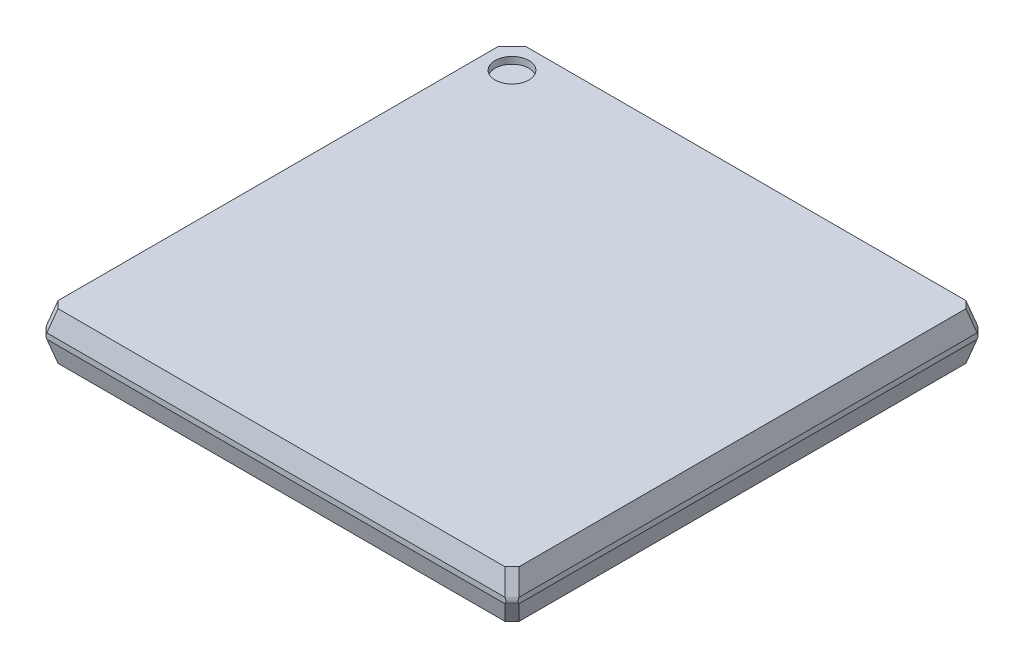
ISO-10303-21;
HEADER;
FILE_DESCRIPTION(('STEP AP214'),'2;1');
FILE_NAME('part.step','',(''),(''),'','','');
FILE_SCHEMA(('AUTOMOTIVE_DESIGN { 1 0 10303 214 1 1 1 1 }'));
ENDSEC;
DATA;
#1=APPLICATION_CONTEXT('core data for automotive mechanical design processes');
#2=APPLICATION_PROTOCOL_DEFINITION('international standard','automotive_design',2000,#1);
#3=PRODUCT_CONTEXT('',#1,'mechanical');
#4=PRODUCT('Part','Part','',(#3));
#5=PRODUCT_RELATED_PRODUCT_CATEGORY('part','',(#4));
#6=PRODUCT_DEFINITION_FORMATION('','',#4);
#7=PRODUCT_DEFINITION_CONTEXT('part definition',#1,'design');
#8=PRODUCT_DEFINITION('design','',#6,#7);
#9=PRODUCT_DEFINITION_SHAPE('','',#8);
#10=(LENGTH_UNIT() NAMED_UNIT(*) SI_UNIT(.MILLI.,.METRE.));
#11=(NAMED_UNIT(*) PLANE_ANGLE_UNIT() SI_UNIT($,.RADIAN.));
#12=(NAMED_UNIT(*) SI_UNIT($,.STERADIAN.) SOLID_ANGLE_UNIT());
#13=UNCERTAINTY_MEASURE_WITH_UNIT(LENGTH_MEASURE(1.E-05),#10,'distance_accuracy_value','');
#14=(GEOMETRIC_REPRESENTATION_CONTEXT(3) GLOBAL_UNCERTAINTY_ASSIGNED_CONTEXT((#13)) GLOBAL_UNIT_ASSIGNED_CONTEXT((#10,
#11,#12)) REPRESENTATION_CONTEXT('',''));
#15=CARTESIAN_POINT('',(0.,0.,0.));
#16=DIRECTION('',(0.,0.,1.));
#17=DIRECTION('',(1.,0.,0.));
#18=AXIS2_PLACEMENT_3D('',#15,#16,#17);
#19=CARTESIAN_POINT('',(-6.,0.5,-6.));
#20=DIRECTION('',(0.,1.,0.));
#21=DIRECTION('',(0.,0.,1.));
#22=AXIS2_PLACEMENT_3D('',#19,#20,#21);
#23=PLANE('',#22);
#24=CARTESIAN_POINT('',(-6.,0.5,-6.));
#25=DIRECTION('',(0.,-1.,0.));
#26=DIRECTION('',(0.,0.,-1.));
#27=AXIS2_PLACEMENT_3D('',#24,#25,#26);
#28=CIRCLE('',#27,0.5);
#29=CARTESIAN_POINT('',(-6.,0.5,-6.5));
#30=VERTEX_POINT('',#29);
#31=EDGE_CURVE('E19',#30,#30,#28,.F.);
#32=ORIENTED_EDGE('',*,*,#31,.T.);
#33=EDGE_LOOP('',(#32));
#34=FACE_BOUND('',#33,.T.);
#35=ADVANCED_FACE('F16',(#34),#23,.T.);
#36=CARTESIAN_POINT('',(-6.,0.7,-6.));
#37=DIRECTION('',(0.,-1.,0.));
#38=DIRECTION('',(0.,0.,-1.));
#39=AXIS2_PLACEMENT_3D('',#36,#37,#38);
#40=CYLINDRICAL_SURFACE('',#39,0.5);
#41=CARTESIAN_POINT('',(-6.,0.7,-6.));
#42=DIRECTION('',(0.,-1.,0.));
#43=DIRECTION('',(0.,0.,-1.));
#44=AXIS2_PLACEMENT_3D('',#41,#42,#43);
#45=CIRCLE('',#44,0.5);
#46=CARTESIAN_POINT('',(-6.,0.7,-6.5));
#47=VERTEX_POINT('',#46);
#48=EDGE_CURVE('E321',#47,#47,#45,.T.);
#49=ORIENTED_EDGE('',*,*,#48,.F.);
#50=EDGE_LOOP('',(#49));
#51=FACE_BOUND('',#50,.T.);
#52=ORIENTED_EDGE('',*,*,#31,.F.);
#53=EDGE_LOOP('',(#52));
#54=FACE_BOUND('',#53,.T.);
#55=ADVANCED_FACE('F376',(#51,#54),#40,.F.);
#56=CARTESIAN_POINT('',(0.,0.7,0.));
#57=DIRECTION('',(0.,1.,0.));
#58=DIRECTION('',(0.,0.,1.));
#59=AXIS2_PLACEMENT_3D('',#56,#57,#58);
#60=PLANE('',#59);
#61=ORIENTED_EDGE('',*,*,#48,.T.);
#62=EDGE_LOOP('',(#61));
#63=FACE_BOUND('',#62,.T.);
#64=DIRECTION('',(0.707106781186548,0.,0.707106781186548));
#65=VECTOR('',#64,1.);
#66=CARTESIAN_POINT('',(-6.70914048806276,0.699999999999998,6.70914048806276));
#67=LINE('',#66,#65);
#68=CARTESIAN_POINT('',(-6.60584541082731,0.699999999999998,6.81243556529822));
#69=VERTEX_POINT('',#68);
#70=CARTESIAN_POINT('',(-6.81243556529822,0.699999999999999,6.60584541082731));
#71=VERTEX_POINT('',#70);
#72=EDGE_CURVE('E296',#69,#71,#67,.F.);
#73=ORIENTED_EDGE('',*,*,#72,.F.);
#74=DIRECTION('',(1.,0.,0.));
#75=VECTOR('',#74,1.);
#76=CARTESIAN_POINT('',(-3.5,0.699999999999999,6.81243556529822));
#77=LINE('',#76,#75);
#78=CARTESIAN_POINT('',(6.60584541082731,0.699999999999999,6.81243556529822));
#79=VERTEX_POINT('',#78);
#80=EDGE_CURVE('E302',#79,#69,#77,.F.);
#81=ORIENTED_EDGE('',*,*,#80,.F.);
#82=DIRECTION('',(0.707106781186548,0.,-0.707106781186548));
#83=VECTOR('',#82,1.);
#84=CARTESIAN_POINT('',(6.60584541082731,0.7,6.81243556529822));
#85=LINE('',#84,#83);
#86=CARTESIAN_POINT('',(6.81243556529822,0.699999999999999,6.60584541082731));
#87=VERTEX_POINT('',#86);
#88=EDGE_CURVE('E328',#79,#87,#85,.T.);
#89=ORIENTED_EDGE('',*,*,#88,.T.);
#90=DIRECTION('',(0.,0.,1.));
#91=VECTOR('',#90,1.);
#92=CARTESIAN_POINT('',(6.81243556529822,0.699999999999999,3.5));
#93=LINE('',#92,#91);
#94=CARTESIAN_POINT('',(6.81243556529822,0.7,-6.60584541082732));
#95=VERTEX_POINT('',#94);
#96=EDGE_CURVE('E231',#95,#87,#93,.T.);
#97=ORIENTED_EDGE('',*,*,#96,.F.);
#98=DIRECTION('',(-0.70710678118655,0.,-0.707106781186545));
#99=VECTOR('',#98,1.);
#100=CARTESIAN_POINT('',(6.70914048806277,0.700000000000003,-6.70914048806276));
#101=LINE('',#100,#99);
#102=CARTESIAN_POINT('',(6.60584541082731,0.700000000000002,-6.81243556529822));
#103=VERTEX_POINT('',#102);
#104=EDGE_CURVE('E244',#103,#95,#101,.F.);
#105=ORIENTED_EDGE('',*,*,#104,.F.);
#106=DIRECTION('',(1.,0.,0.));
#107=VECTOR('',#106,1.);
#108=CARTESIAN_POINT('',(3.5,0.699999999999999,-6.81243556529822));
#109=LINE('',#108,#107);
#110=CARTESIAN_POINT('',(-6.39925525635641,0.7,-6.81243556529822));
#111=VERTEX_POINT('',#110);
#112=EDGE_CURVE('E257',#111,#103,#109,.T.);
#113=ORIENTED_EDGE('',*,*,#112,.F.);
#114=DIRECTION('',(-0.707106781186547,0.,0.707106781186548));
#115=VECTOR('',#114,1.);
#116=CARTESIAN_POINT('',(-6.60584541082731,0.699999999999999,-6.60584541082731));
#117=LINE('',#116,#115);
#118=CARTESIAN_POINT('',(-6.81243556529822,0.699999999999999,-6.39925525635641));
#119=VERTEX_POINT('',#118);
#120=EDGE_CURVE('E270',#119,#111,#117,.F.);
#121=ORIENTED_EDGE('',*,*,#120,.F.);
#122=DIRECTION('',(0.,0.,1.));
#123=VECTOR('',#122,1.);
#124=CARTESIAN_POINT('',(-6.81243556529822,0.699999999999999,-3.5));
#125=LINE('',#124,#123);
#126=EDGE_CURVE('E283',#71,#119,#125,.F.);
#127=ORIENTED_EDGE('',*,*,#126,.F.);
#128=EDGE_LOOP('',(#73,#81,#89,#97,#105,#113,#121,#127));
#129=FACE_BOUND('',#128,.T.);
#130=ADVANCED_FACE('F373',(#63,#129),#60,.T.);
#131=CARTESIAN_POINT('',(-3.5,0.35,6.90621778264911));
#132=DIRECTION('',(0.,0.258819045102521,0.965925826289068));
#133=DIRECTION('',(0.,-0.965925826289068,0.258819045102521));
#134=AXIS2_PLACEMENT_3D('',#131,#132,#133);
#135=PLANE('',#134);
#136=ORIENTED_EDGE('',*,*,#80,.T.);
#137=DIRECTION('',(0.250562807085732,0.93511312653103,-0.250562807085732));
#138=VECTOR('',#137,1.);
#139=CARTESIAN_POINT('',(-6.2790134803474,1.91975337008685,6.4856036348183));
#140=LINE('',#139,#138);
#141=CARTESIAN_POINT('',(-6.77141022669538,0.0821036952345704,6.97800038116629));
#142=VERTEX_POINT('',#141);
#143=EDGE_CURVE('E299',#142,#69,#140,.T.);
#144=ORIENTED_EDGE('',*,*,#143,.F.);
#145=DIRECTION('',(1.,0.,0.));
#146=VECTOR('',#145,1.);
#147=CARTESIAN_POINT('',(-3.5,0.0821036952345708,6.97800038116629));
#148=LINE('',#147,#146);
#149=CARTESIAN_POINT('',(6.77141022669538,0.0821036952345713,6.97800038116629));
#150=VERTEX_POINT('',#149);
#151=EDGE_CURVE('E305',#150,#142,#148,.F.);
#152=ORIENTED_EDGE('',*,*,#151,.F.);
#153=DIRECTION('',(-0.250562807085731,0.93511312653103,-0.250562807085731));
#154=VECTOR('',#153,1.);
#155=CARTESIAN_POINT('',(6.2790134803474,1.91975337008684,6.48560363481831));
#156=LINE('',#155,#154);
#157=EDGE_CURVE('E218',#79,#150,#156,.F.);
#158=ORIENTED_EDGE('',*,*,#157,.F.);
#159=EDGE_LOOP('',(#136,#144,#152,#158));
#160=FACE_BOUND('',#159,.T.);
#161=ADVANCED_FACE('F478',(#160),#135,.T.);
#162=CARTESIAN_POINT('',(-6.38230855758285,1.91975337008685,6.38230855758285));
#163=DIRECTION('',(-0.661224832946645,0.354349320006915,0.661224832946645));
#164=DIRECTION('',(0.707106781186548,0.,0.707106781186548));
#165=AXIS2_PLACEMENT_3D('',#162,#163,#164);
#166=PLANE('',#165);
#167=ORIENTED_EDGE('',*,*,#72,.T.);
#168=DIRECTION('',(0.250562807085732,0.935113126531029,-0.250562807085731));
#169=VECTOR('',#168,1.);
#170=CARTESIAN_POINT('',(-6.97800038116629,0.0821036952345706,6.77141022669538));
#171=LINE('',#170,#169);
#172=CARTESIAN_POINT('',(-6.97800038116629,0.082103695234571,6.77141022669538));
#173=VERTEX_POINT('',#172);
#174=EDGE_CURVE('E293',#173,#71,#171,.T.);
#175=ORIENTED_EDGE('',*,*,#174,.F.);
#176=DIRECTION('',(0.,0.881412416655406,-0.472347490483095));
#177=VECTOR('',#176,1.);
#178=CARTESIAN_POINT('',(-6.97800038116629,0.0708698640013826,6.77743041870906));
#179=LINE('',#178,#177);
#180=CARTESIAN_POINT('',(-6.97800038116629,0.0708698640013788,6.77743041870907));
#181=VERTEX_POINT('',#180);
#182=EDGE_CURVE('E290',#181,#173,#179,.T.);
#183=ORIENTED_EDGE('',*,*,#182,.F.);
#184=DIRECTION('',(-0.707106781186548,0.,-0.707106781186548));
#185=VECTOR('',#184,1.);
#186=CARTESIAN_POINT('',(-6.87771539993768,0.0708698640013844,6.87771539993768));
#187=LINE('',#186,#185);
#188=CARTESIAN_POINT('',(-6.77743041870907,0.0708698640013796,6.97800038116629));
#189=VERTEX_POINT('',#188);
#190=EDGE_CURVE('E369',#189,#181,#187,.T.);
#191=ORIENTED_EDGE('',*,*,#190,.F.);
#192=DIRECTION('',(-0.472347490483105,-0.8814124166554,0.));
#193=VECTOR('',#192,1.);
#194=CARTESIAN_POINT('',(-6.77141022669538,0.0821036952345708,6.97800038116629));
#195=LINE('',#194,#193);
#196=EDGE_CURVE('E308',#142,#189,#195,.T.);
#197=ORIENTED_EDGE('',*,*,#196,.F.);
#198=ORIENTED_EDGE('',*,*,#143,.T.);
#199=EDGE_LOOP('',(#167,#175,#183,#191,#197,#198));
#200=FACE_BOUND('',#199,.T.);
#201=ADVANCED_FACE('F474',(#200),#166,.T.);
#202=CARTESIAN_POINT('',(-6.90621778264911,0.35,-3.5));
#203=DIRECTION('',(-0.965925826289068,0.258819045102521,0.));
#204=DIRECTION('',(-0.258819045102521,-0.965925826289068,0.));
#205=AXIS2_PLACEMENT_3D('',#202,#203,#204);
#206=PLANE('',#205);
#207=ORIENTED_EDGE('',*,*,#126,.T.);
#208=DIRECTION('',(0.250562807085731,0.93511312653103,0.250562807085731));
#209=VECTOR('',#208,1.);
#210=CARTESIAN_POINT('',(-6.49857372011194,1.87134835279253,-6.08539341117013));
#211=LINE('',#210,#209);
#212=CARTESIAN_POINT('',(-6.97800038116629,0.0821036952345714,-6.56482007222448));
#213=VERTEX_POINT('',#212);
#214=EDGE_CURVE('E280',#213,#119,#211,.T.);
#215=ORIENTED_EDGE('',*,*,#214,.F.);
#216=DIRECTION('',(0.,0.,1.));
#217=VECTOR('',#216,1.);
#218=CARTESIAN_POINT('',(-6.97800038116629,0.0821036952345711,-3.5));
#219=LINE('',#218,#217);
#220=EDGE_CURVE('E286',#173,#213,#219,.F.);
#221=ORIENTED_EDGE('',*,*,#220,.F.);
#222=ORIENTED_EDGE('',*,*,#174,.T.);
#223=EDGE_LOOP('',(#207,#215,#221,#222));
#224=FACE_BOUND('',#223,.T.);
#225=ADVANCED_FACE('F470',(#224),#206,.T.);
#226=CARTESIAN_POINT('',(-6.29198356564103,1.87134835279253,-6.29198356564103));
#227=DIRECTION('',(-0.661224832946645,0.354349320006915,-0.661224832946645));
#228=DIRECTION('',(-0.707106781186547,0.,0.707106781186548));
#229=AXIS2_PLACEMENT_3D('',#226,#227,#228);
#230=PLANE('',#229);
#231=ORIENTED_EDGE('',*,*,#120,.T.);
#232=DIRECTION('',(0.250562807085728,0.93511312653103,0.250562807085732));
#233=VECTOR('',#232,1.);
#234=CARTESIAN_POINT('',(-6.56482007222448,0.0821036952345708,-6.97800038116629));
#235=LINE('',#234,#233);
#236=CARTESIAN_POINT('',(-6.56482007222448,0.082103695234571,-6.97800038116629));
#237=VERTEX_POINT('',#236);
#238=EDGE_CURVE('E267',#237,#111,#235,.T.);
#239=ORIENTED_EDGE('',*,*,#238,.F.);
#240=DIRECTION('',(0.472347490483115,0.881412416655395,0.));
#241=VECTOR('',#240,1.);
#242=CARTESIAN_POINT('',(-6.57084026423816,0.0708698640013832,-6.97800038116629));
#243=LINE('',#242,#241);
#244=CARTESIAN_POINT('',(-6.57084026423816,0.0708698640013806,-6.97800038116629));
#245=VERTEX_POINT('',#244);
#246=EDGE_CURVE('E264',#245,#237,#243,.T.);
#247=ORIENTED_EDGE('',*,*,#246,.F.);
#248=DIRECTION('',(0.707106781186548,0.,-0.707106781186547));
#249=VECTOR('',#248,1.);
#250=CARTESIAN_POINT('',(-6.77442032270222,0.070869864001383,-6.77442032270223));
#251=LINE('',#250,#249);
#252=CARTESIAN_POINT('',(-6.97800038116629,0.0708698640013806,-6.57084026423816));
#253=VERTEX_POINT('',#252);
#254=EDGE_CURVE('E362',#253,#245,#251,.T.);
#255=ORIENTED_EDGE('',*,*,#254,.F.);
#256=DIRECTION('',(0.,-0.881412416655395,-0.472347490483115));
#257=VECTOR('',#256,1.);
#258=CARTESIAN_POINT('',(-6.97800038116629,0.0821036952345711,-6.56482007222448));
#259=LINE('',#258,#257);
#260=EDGE_CURVE('E289',#213,#253,#259,.T.);
#261=ORIENTED_EDGE('',*,*,#260,.F.);
#262=ORIENTED_EDGE('',*,*,#214,.T.);
#263=EDGE_LOOP('',(#231,#239,#247,#255,#261,#262));
#264=FACE_BOUND('',#263,.T.);
#265=ADVANCED_FACE('F466',(#264),#230,.T.);
#266=CARTESIAN_POINT('',(3.5,0.35,-6.90621778264911));
#267=DIRECTION('',(0.,0.258819045102521,-0.965925826289068));
#268=DIRECTION('',(0.,0.965925826289068,0.258819045102521));
#269=AXIS2_PLACEMENT_3D('',#266,#267,#268);
#270=PLANE('',#269);
#271=ORIENTED_EDGE('',*,*,#112,.T.);
#272=DIRECTION('',(-0.25056280708573,0.93511312653103,0.250562807085732));
#273=VECTOR('',#272,1.);
#274=CARTESIAN_POINT('',(6.2790134803474,1.91975337008685,-6.48560363481831));
#275=LINE('',#274,#273);
#276=CARTESIAN_POINT('',(6.77141022669538,0.0821036952345713,-6.97800038116629));
#277=VERTEX_POINT('',#276);
#278=EDGE_CURVE('E254',#277,#103,#275,.T.);
#279=ORIENTED_EDGE('',*,*,#278,.F.);
#280=DIRECTION('',(-1.,0.,0.));
#281=VECTOR('',#280,1.);
#282=CARTESIAN_POINT('',(3.5,0.0821036952345711,-6.97800038116629));
#283=LINE('',#282,#281);
#284=EDGE_CURVE('E260',#237,#277,#283,.F.);
#285=ORIENTED_EDGE('',*,*,#284,.F.);
#286=ORIENTED_EDGE('',*,*,#238,.T.);
#287=EDGE_LOOP('',(#271,#279,#285,#286));
#288=FACE_BOUND('',#287,.T.);
#289=ADVANCED_FACE('F462',(#288),#270,.T.);
#290=CARTESIAN_POINT('',(6.38230855758286,1.91975337008685,-6.38230855758285));
#291=DIRECTION('',(0.661224832946643,0.354349320006914,-0.661224832946647));
#292=DIRECTION('',(-0.70710678118655,0.,-0.707106781186545));
#293=AXIS2_PLACEMENT_3D('',#290,#291,#292);
#294=PLANE('',#293);
#295=ORIENTED_EDGE('',*,*,#104,.T.);
#296=DIRECTION('',(-0.25056280708573,0.93511312653103,0.250562807085731));
#297=VECTOR('',#296,1.);
#298=CARTESIAN_POINT('',(6.97800038116629,0.0821036952345711,-6.77141022669538));
#299=LINE('',#298,#297);
#300=CARTESIAN_POINT('',(6.97800038116629,0.0821036952345716,-6.77141022669538));
#301=VERTEX_POINT('',#300);
#302=EDGE_CURVE('E241',#301,#95,#299,.T.);
#303=ORIENTED_EDGE('',*,*,#302,.F.);
#304=DIRECTION('',(0.,0.881412416655397,0.472347490483112));
#305=VECTOR('',#304,1.);
#306=CARTESIAN_POINT('',(6.97800038116629,0.0708698640013836,-6.77743041870906));
#307=LINE('',#306,#305);
#308=CARTESIAN_POINT('',(6.97800038116629,0.0708698640013795,-6.77743041870906));
#309=VERTEX_POINT('',#308);
#310=EDGE_CURVE('E238',#309,#301,#307,.T.);
#311=ORIENTED_EDGE('',*,*,#310,.F.);
#312=DIRECTION('',(-0.707106781186549,0.,-0.707106781186546));
#313=VECTOR('',#312,1.);
#314=CARTESIAN_POINT('',(6.87771539993768,0.0708698640013808,-6.87771539993767));
#315=LINE('',#314,#313);
#316=CARTESIAN_POINT('',(6.77743041870904,0.0708698640014305,-6.97800038116629));
#317=VERTEX_POINT('',#316);
#318=EDGE_CURVE('E354',#317,#309,#315,.F.);
#319=ORIENTED_EDGE('',*,*,#318,.F.);
#320=DIRECTION('',(0.47234749048371,-0.881412416655076,0.));
#321=VECTOR('',#320,1.);
#322=CARTESIAN_POINT('',(6.77141022669538,0.0821036952345711,-6.97800038116629));
#323=LINE('',#322,#321);
#324=EDGE_CURVE('E263',#277,#317,#323,.T.);
#325=ORIENTED_EDGE('',*,*,#324,.F.);
#326=ORIENTED_EDGE('',*,*,#278,.T.);
#327=EDGE_LOOP('',(#295,#303,#311,#319,#325,#326));
#328=FACE_BOUND('',#327,.T.);
#329=ADVANCED_FACE('F458',(#328),#294,.T.);
#330=CARTESIAN_POINT('',(6.90621778264911,0.35,3.5));
#331=DIRECTION('',(0.965925826289069,0.258819045102519,0.));
#332=DIRECTION('',(-0.258819045102519,0.965925826289069,0.));
#333=AXIS2_PLACEMENT_3D('',#330,#331,#332);
#334=PLANE('',#333);
#335=ORIENTED_EDGE('',*,*,#96,.T.);
#336=DIRECTION('',(-0.250562807085731,0.93511312653103,-0.250562807085731));
#337=VECTOR('',#336,1.);
#338=CARTESIAN_POINT('',(6.48560363481831,1.91975337008684,6.2790134803474));
#339=LINE('',#338,#337);
#340=CARTESIAN_POINT('',(6.97800038116629,0.082103695234571,6.77141022669538));
#341=VERTEX_POINT('',#340);
#342=EDGE_CURVE('E228',#341,#87,#339,.T.);
#343=ORIENTED_EDGE('',*,*,#342,.F.);
#344=DIRECTION('',(0.,0.,-1.));
#345=VECTOR('',#344,1.);
#346=CARTESIAN_POINT('',(6.97800038116629,0.0821036952345716,3.5));
#347=LINE('',#346,#345);
#348=EDGE_CURVE('E234',#301,#341,#347,.F.);
#349=ORIENTED_EDGE('',*,*,#348,.F.);
#350=ORIENTED_EDGE('',*,*,#302,.T.);
#351=EDGE_LOOP('',(#335,#343,#349,#350));
#352=FACE_BOUND('',#351,.T.);
#353=ADVANCED_FACE('F454',(#352),#334,.T.);
#354=CARTESIAN_POINT('',(6.38230855758286,1.91975337008684,6.38230855758285));
#355=DIRECTION('',(0.661224832946645,0.354349320006914,0.661224832946645));
#356=DIRECTION('',(0.707106781186548,0.,-0.707106781186548));
#357=AXIS2_PLACEMENT_3D('',#354,#355,#356);
#358=PLANE('',#357);
#359=DIRECTION('',(-0.472347490483131,0.881412416655386,0.));
#360=VECTOR('',#359,1.);
#361=CARTESIAN_POINT('',(6.77743041870906,0.0708698640013834,6.97800038116629));
#362=LINE('',#361,#360);
#363=CARTESIAN_POINT('',(6.77743041870906,0.0708698640013824,6.97800038116629));
#364=VERTEX_POINT('',#363);
#365=EDGE_CURVE('E187',#364,#150,#362,.T.);
#366=ORIENTED_EDGE('',*,*,#365,.F.);
#367=DIRECTION('',(0.707106781186547,0.,-0.707106781186548));
#368=VECTOR('',#367,1.);
#369=CARTESIAN_POINT('',(6.87771539993768,0.070869864001383,6.87771539993767));
#370=LINE('',#369,#368);
#371=CARTESIAN_POINT('',(6.97800038116629,0.0708698640013791,6.77743041870906));
#372=VERTEX_POINT('',#371);
#373=EDGE_CURVE('E183',#372,#364,#370,.F.);
#374=ORIENTED_EDGE('',*,*,#373,.F.);
#375=DIRECTION('',(0.,-0.881412416655405,0.472347490483096));
#376=VECTOR('',#375,1.);
#377=CARTESIAN_POINT('',(6.97800038116629,0.0821036952345719,6.77141022669538));
#378=LINE('',#377,#376);
#379=EDGE_CURVE('E237',#341,#372,#378,.T.);
#380=ORIENTED_EDGE('',*,*,#379,.F.);
#381=ORIENTED_EDGE('',*,*,#342,.T.);
#382=ORIENTED_EDGE('',*,*,#88,.F.);
#383=ORIENTED_EDGE('',*,*,#157,.T.);
#384=EDGE_LOOP('',(#366,#374,#380,#381,#382,#383));
#385=FACE_BOUND('',#384,.T.);
#386=ADVANCED_FACE('F451',(#385),#358,.T.);
#387=CARTESIAN_POINT('',(6.74547043334835,0.,6.74547043334834));
#388=DIRECTION('',(0.707106781186547,0.,-0.707106781186548));
#389=DIRECTION('',(-0.707106781186548,0.,-0.707106781186547));
#390=AXIS2_PLACEMENT_3D('',#387,#388,#389);
#391=CYLINDRICAL_SURFACE('',#390,0.2);
#392=CARTESIAN_POINT('',(6.5129404855304,0.,6.97800038116629));
#393=DIRECTION('',(0.,0.,1.));
#394=DIRECTION('',(1.,0.,0.));
#395=AXIS2_PLACEMENT_3D('',#392,#393,#394);
#396=ELLIPSE('',#395,0.282842712474619,0.2);
#397=CARTESIAN_POINT('',(6.77743041870906,-0.0708698640013771,6.97800038116629));
#398=VERTEX_POINT('',#397);
#399=EDGE_CURVE('E176',#398,#364,#396,.T.);
#400=ORIENTED_EDGE('',*,*,#399,.F.);
#401=DIRECTION('',(0.707106781186548,0.,-0.707106781186548));
#402=VECTOR('',#401,1.);
#403=CARTESIAN_POINT('',(6.87771539993768,-0.0708698640013812,6.87771539993767));
#404=LINE('',#403,#402);
#405=CARTESIAN_POINT('',(6.97800038116629,-0.0708698640013795,6.77743041870906));
#406=VERTEX_POINT('',#405);
#407=EDGE_CURVE('E181',#406,#398,#404,.F.);
#408=ORIENTED_EDGE('',*,*,#407,.F.);
#409=CARTESIAN_POINT('',(6.97800038116629,0.,6.5129404855304));
#410=DIRECTION('',(1.,0.,0.));
#411=DIRECTION('',(0.,0.,-1.));
#412=AXIS2_PLACEMENT_3D('',#409,#410,#411);
#413=ELLIPSE('',#412,0.282842712474619,0.2);
#414=EDGE_CURVE('E349',#372,#406,#413,.T.);
#415=ORIENTED_EDGE('',*,*,#414,.F.);
#416=ORIENTED_EDGE('',*,*,#373,.T.);
#417=EDGE_LOOP('',(#400,#408,#415,#416));
#418=FACE_BOUND('',#417,.T.);
#419=ADVANCED_FACE('F178',(#418),#391,.T.);
#420=CARTESIAN_POINT('',(-3.5,0.,6.97800038116629));
#421=DIRECTION('',(0.,0.,1.));
#422=DIRECTION('',(1.,0.,0.));
#423=AXIS2_PLACEMENT_3D('',#420,#421,#422);
#424=PLANE('',#423);
#425=ORIENTED_EDGE('',*,*,#196,.T.);
#426=CARTESIAN_POINT('',(-6.51294048553041,0.,6.97800038116629));
#427=DIRECTION('',(0.,0.,1.));
#428=DIRECTION('',(-1.,0.,0.));
#429=AXIS2_PLACEMENT_3D('',#426,#427,#428);
#430=ELLIPSE('',#429,0.282842712474619,0.2);
#431=CARTESIAN_POINT('',(-6.77743041870906,-0.0708698640013803,6.97800038116629));
#432=VERTEX_POINT('',#431);
#433=EDGE_CURVE('E367',#432,#189,#430,.F.);
#434=ORIENTED_EDGE('',*,*,#433,.F.);
#435=DIRECTION('',(0.472347490483118,-0.881412416655393,0.));
#436=VECTOR('',#435,1.);
#437=CARTESIAN_POINT('',(-6.77743041870906,-0.0708698640013833,6.97800038116629));
#438=LINE('',#437,#436);
#439=CARTESIAN_POINT('',(-6.77141022669538,-0.0821036952345709,6.97800038116629));
#440=VERTEX_POINT('',#439);
#441=EDGE_CURVE('E188',#432,#440,#438,.T.);
#442=ORIENTED_EDGE('',*,*,#441,.T.);
#443=DIRECTION('',(1.,0.,0.));
#444=VECTOR('',#443,1.);
#445=CARTESIAN_POINT('',(-3.5,-0.0821036952345706,6.97800038116629));
#446=LINE('',#445,#444);
#447=CARTESIAN_POINT('',(6.77141022669538,-0.0821036952345688,6.97800038116629));
#448=VERTEX_POINT('',#447);
#449=EDGE_CURVE('E194',#448,#440,#446,.F.);
#450=ORIENTED_EDGE('',*,*,#449,.F.);
#451=DIRECTION('',(-0.472347490483091,-0.881412416655408,0.));
#452=VECTOR('',#451,1.);
#453=CARTESIAN_POINT('',(6.77743041870906,-0.0708698640013812,6.97800038116629));
#454=LINE('',#453,#452);
#455=EDGE_CURVE('E191',#398,#448,#454,.T.);
#456=ORIENTED_EDGE('',*,*,#455,.F.);
#457=ORIENTED_EDGE('',*,*,#399,.T.);
#458=ORIENTED_EDGE('',*,*,#365,.T.);
#459=ORIENTED_EDGE('',*,*,#151,.T.);
#460=EDGE_LOOP('',(#425,#434,#442,#450,#456,#457,#458,#459));
#461=FACE_BOUND('',#460,.T.);
#462=ADVANCED_FACE('F192',(#461),#424,.T.);
#463=CARTESIAN_POINT('',(-6.74547043334835,0.,6.74547043334835));
#464=DIRECTION('',(-0.707106781186548,0.,-0.707106781186548));
#465=DIRECTION('',(-0.707106781186548,0.,0.707106781186548));
#466=AXIS2_PLACEMENT_3D('',#463,#464,#465);
#467=CYLINDRICAL_SURFACE('',#466,0.2);
#468=ORIENTED_EDGE('',*,*,#433,.T.);
#469=ORIENTED_EDGE('',*,*,#190,.T.);
#470=CARTESIAN_POINT('',(-6.97800038116629,0.,6.51294048553041));
#471=DIRECTION('',(-1.,0.,0.));
#472=DIRECTION('',(0.,0.,-1.));
#473=AXIS2_PLACEMENT_3D('',#470,#471,#472);
#474=ELLIPSE('',#473,0.282842712474619,0.2);
#475=CARTESIAN_POINT('',(-6.97800038116629,-0.0708698640013854,6.77743041870906));
#476=VERTEX_POINT('',#475);
#477=EDGE_CURVE('E363',#476,#181,#474,.T.);
#478=ORIENTED_EDGE('',*,*,#477,.F.);
#479=DIRECTION('',(0.707106781186548,0.,0.707106781186548));
#480=VECTOR('',#479,1.);
#481=CARTESIAN_POINT('',(-6.87771539993767,-0.0708698640013818,6.87771539993767));
#482=LINE('',#481,#480);
#483=EDGE_CURVE('E317',#432,#476,#482,.F.);
#484=ORIENTED_EDGE('',*,*,#483,.F.);
#485=EDGE_LOOP('',(#468,#469,#478,#484));
#486=FACE_BOUND('',#485,.T.);
#487=ADVANCED_FACE('F442',(#486),#467,.T.);
#488=CARTESIAN_POINT('',(-6.97800038116629,0.,-3.5));
#489=DIRECTION('',(-1.,0.,0.));
#490=DIRECTION('',(0.,0.,1.));
#491=AXIS2_PLACEMENT_3D('',#488,#489,#490);
#492=PLANE('',#491);
#493=DIRECTION('',(0.,-0.881412416655361,-0.472347490483179));
#494=VECTOR('',#493,1.);
#495=CARTESIAN_POINT('',(-6.97800038116629,-0.0708698640013818,6.77743041870906));
#496=LINE('',#495,#494);
#497=CARTESIAN_POINT('',(-6.97800038116629,-0.0821036952345675,6.77141022669538));
#498=VERTEX_POINT('',#497);
#499=EDGE_CURVE('E215',#476,#498,#496,.T.);
#500=ORIENTED_EDGE('',*,*,#499,.F.);
#501=ORIENTED_EDGE('',*,*,#477,.T.);
#502=ORIENTED_EDGE('',*,*,#182,.T.);
#503=ORIENTED_EDGE('',*,*,#220,.T.);
#504=ORIENTED_EDGE('',*,*,#260,.T.);
#505=CARTESIAN_POINT('',(-6.97800038116629,0.,-6.3063503310595));
#506=DIRECTION('',(-1.,0.,0.));
#507=DIRECTION('',(0.,0.,-1.));
#508=AXIS2_PLACEMENT_3D('',#505,#506,#507);
#509=ELLIPSE('',#508,0.282842712474619,0.2);
#510=CARTESIAN_POINT('',(-6.97800038116629,-0.0708698640013794,-6.57084026423816));
#511=VERTEX_POINT('',#510);
#512=EDGE_CURVE('E359',#511,#253,#509,.F.);
#513=ORIENTED_EDGE('',*,*,#512,.F.);
#514=DIRECTION('',(0.,-0.8814124166554,0.472347490483105));
#515=VECTOR('',#514,1.);
#516=CARTESIAN_POINT('',(-6.97800038116629,-0.0708698640013826,-6.57084026423816));
#517=LINE('',#516,#515);
#518=CARTESIAN_POINT('',(-6.97800038116629,-0.0821036952345706,-6.56482007222448));
#519=VERTEX_POINT('',#518);
#520=EDGE_CURVE('E366',#511,#519,#517,.T.);
#521=ORIENTED_EDGE('',*,*,#520,.T.);
#522=DIRECTION('',(0.,0.,1.));
#523=VECTOR('',#522,1.);
#524=CARTESIAN_POINT('',(-6.97800038116629,-0.0821036952345704,-3.5));
#525=LINE('',#524,#523);
#526=EDGE_CURVE('E754',#498,#519,#525,.F.);
#527=ORIENTED_EDGE('',*,*,#526,.F.);
#528=EDGE_LOOP('',(#500,#501,#502,#503,#504,#513,#521,#527));
#529=FACE_BOUND('',#528,.T.);
#530=ADVANCED_FACE('F438',(#529),#492,.T.);
#531=CARTESIAN_POINT('',(-6.64217535611289,0.,-6.6421753561129));
#532=DIRECTION('',(0.707106781186548,0.,-0.707106781186547));
#533=DIRECTION('',(-0.707106781186547,0.,-0.707106781186548));
#534=AXIS2_PLACEMENT_3D('',#531,#532,#533);
#535=CYLINDRICAL_SURFACE('',#534,0.2);
#536=ORIENTED_EDGE('',*,*,#512,.T.);
#537=ORIENTED_EDGE('',*,*,#254,.T.);
#538=CARTESIAN_POINT('',(-6.3063503310595,0.,-6.97800038116629));
#539=DIRECTION('',(0.,0.,-1.));
#540=DIRECTION('',(1.,0.,0.));
#541=AXIS2_PLACEMENT_3D('',#538,#539,#540);
#542=ELLIPSE('',#541,0.282842712474619,0.2);
#543=CARTESIAN_POINT('',(-6.57084026423816,-0.0708698640013832,-6.97800038116629));
#544=VERTEX_POINT('',#543);
#545=EDGE_CURVE('E355',#544,#245,#542,.T.);
#546=ORIENTED_EDGE('',*,*,#545,.F.);
#547=DIRECTION('',(-0.707106781186547,0.,0.707106781186548));
#548=VECTOR('',#547,1.);
#549=CARTESIAN_POINT('',(-6.77442032270223,-0.0708698640013829,-6.77442032270223));
#550=LINE('',#549,#548);
#551=EDGE_CURVE('E276',#511,#544,#550,.F.);
#552=ORIENTED_EDGE('',*,*,#551,.F.);
#553=EDGE_LOOP('',(#536,#537,#546,#552));
#554=FACE_BOUND('',#553,.T.);
#555=ADVANCED_FACE('F434',(#554),#535,.T.);
#556=CARTESIAN_POINT('',(3.5,0.,-6.97800038116629));
#557=DIRECTION('',(0.,0.,-1.));
#558=DIRECTION('',(-1.,0.,0.));
#559=AXIS2_PLACEMENT_3D('',#556,#557,#558);
#560=PLANE('',#559);
#561=DIRECTION('',(0.472347490483151,-0.881412416655376,0.));
#562=VECTOR('',#561,1.);
#563=CARTESIAN_POINT('',(-6.57084026423816,-0.0708698640013831,-6.97800038116629));
#564=LINE('',#563,#562);
#565=CARTESIAN_POINT('',(-6.56482007222448,-0.0821036952345717,-6.97800038116629));
#566=VERTEX_POINT('',#565);
#567=EDGE_CURVE('E277',#544,#566,#564,.T.);
#568=ORIENTED_EDGE('',*,*,#567,.F.);
#569=ORIENTED_EDGE('',*,*,#545,.T.);
#570=ORIENTED_EDGE('',*,*,#246,.T.);
#571=ORIENTED_EDGE('',*,*,#284,.T.);
#572=ORIENTED_EDGE('',*,*,#324,.T.);
#573=CARTESIAN_POINT('',(6.5129404855304,0.,-6.97800038116629));
#574=DIRECTION('',(0.,0.,-1.));
#575=DIRECTION('',(-1.,0.,0.));
#576=AXIS2_PLACEMENT_3D('',#573,#574,#575);
#577=ELLIPSE('',#576,0.28284271247462,0.2);
#578=CARTESIAN_POINT('',(6.77743041870904,-0.0708698640014275,-6.97800038116629));
#579=VERTEX_POINT('',#578);
#580=EDGE_CURVE('E351',#579,#317,#577,.F.);
#581=ORIENTED_EDGE('',*,*,#580,.F.);
#582=DIRECTION('',(-0.472347490483687,-0.881412416655089,0.));
#583=VECTOR('',#582,1.);
#584=CARTESIAN_POINT('',(6.77743041870907,-0.0708698640013823,-6.97800038116629));
#585=LINE('',#584,#583);
#586=CARTESIAN_POINT('',(6.77141022669538,-0.0821036952345705,-6.97800038116629));
#587=VERTEX_POINT('',#586);
#588=EDGE_CURVE('E358',#579,#587,#585,.T.);
#589=ORIENTED_EDGE('',*,*,#588,.T.);
#590=DIRECTION('',(1.,0.,0.));
#591=VECTOR('',#590,1.);
#592=CARTESIAN_POINT('',(3.5,-0.0821036952345706,-6.97800038116629));
#593=LINE('',#592,#591);
#594=EDGE_CURVE('E729',#566,#587,#593,.T.);
#595=ORIENTED_EDGE('',*,*,#594,.F.);
#596=EDGE_LOOP('',(#568,#569,#570,#571,#572,#581,#589,#595));
#597=FACE_BOUND('',#596,.T.);
#598=ADVANCED_FACE('F430',(#597),#560,.T.);
#599=CARTESIAN_POINT('',(6.74547043334835,0.,-6.74547043334834));
#600=DIRECTION('',(-0.707106781186549,0.,-0.707106781186546));
#601=DIRECTION('',(-0.707106781186546,0.,0.707106781186549));
#602=AXIS2_PLACEMENT_3D('',#599,#600,#601);
#603=CYLINDRICAL_SURFACE('',#602,0.2);
#604=ORIENTED_EDGE('',*,*,#580,.T.);
#605=ORIENTED_EDGE('',*,*,#318,.T.);
#606=CARTESIAN_POINT('',(6.97800038116629,0.,-6.5129404855304));
#607=DIRECTION('',(1.,0.,0.));
#608=DIRECTION('',(0.,0.,-1.));
#609=AXIS2_PLACEMENT_3D('',#606,#607,#608);
#610=ELLIPSE('',#609,0.282842712474618,0.2);
#611=CARTESIAN_POINT('',(6.97800038116629,-0.0708698640013805,-6.77743041870906));
#612=VERTEX_POINT('',#611);
#613=EDGE_CURVE('E202',#612,#309,#610,.T.);
#614=ORIENTED_EDGE('',*,*,#613,.F.);
#615=DIRECTION('',(-0.70710678118655,0.,-0.707106781186545));
#616=VECTOR('',#615,1.);
#617=CARTESIAN_POINT('',(6.87771539993768,-0.0708698640013807,-6.87771539993767));
#618=LINE('',#617,#616);
#619=EDGE_CURVE('E250',#579,#612,#618,.F.);
#620=ORIENTED_EDGE('',*,*,#619,.F.);
#621=EDGE_LOOP('',(#604,#605,#614,#620));
#622=FACE_BOUND('',#621,.T.);
#623=ADVANCED_FACE('F426',(#622),#603,.T.);
#624=CARTESIAN_POINT('',(6.97800038116629,0.,3.5));
#625=DIRECTION('',(1.,0.,0.));
#626=DIRECTION('',(0.,0.,-1.));
#627=AXIS2_PLACEMENT_3D('',#624,#625,#626);
#628=PLANE('',#627);
#629=DIRECTION('',(0.,-0.881412416655385,0.472347490483133));
#630=VECTOR('',#629,1.);
#631=CARTESIAN_POINT('',(6.97800038116629,-0.0708698640013836,-6.77743041870906));
#632=LINE('',#631,#630);
#633=CARTESIAN_POINT('',(6.97800038116629,-0.0821036952345709,-6.77141022669538));
#634=VERTEX_POINT('',#633);
#635=EDGE_CURVE('E251',#612,#634,#632,.T.);
#636=ORIENTED_EDGE('',*,*,#635,.F.);
#637=ORIENTED_EDGE('',*,*,#613,.T.);
#638=ORIENTED_EDGE('',*,*,#310,.T.);
#639=ORIENTED_EDGE('',*,*,#348,.T.);
#640=ORIENTED_EDGE('',*,*,#379,.T.);
#641=ORIENTED_EDGE('',*,*,#414,.T.);
#642=DIRECTION('',(0.,0.881412416655393,0.472347490483119));
#643=VECTOR('',#642,1.);
#644=CARTESIAN_POINT('',(6.97800038116629,-0.082103695234569,6.77141022669538));
#645=LINE('',#644,#643);
#646=CARTESIAN_POINT('',(6.97800038116629,-0.0821036952345684,6.77141022669538));
#647=VERTEX_POINT('',#646);
#648=EDGE_CURVE('E200',#647,#406,#645,.T.);
#649=ORIENTED_EDGE('',*,*,#648,.F.);
#650=DIRECTION('',(0.,0.,1.));
#651=VECTOR('',#650,1.);
#652=CARTESIAN_POINT('',(6.97800038116629,-0.0821036952345693,3.5));
#653=LINE('',#652,#651);
#654=EDGE_CURVE('E225',#634,#647,#653,.T.);
#655=ORIENTED_EDGE('',*,*,#654,.F.);
#656=EDGE_LOOP('',(#636,#637,#638,#639,#640,#641,#649,#655));
#657=FACE_BOUND('',#656,.T.);
#658=ADVANCED_FACE('F423',(#657),#628,.T.);
#659=CARTESIAN_POINT('',(6.38230855758286,-1.91975337008684,6.38230855758285));
#660=DIRECTION('',(0.661224832946645,-0.354349320006914,0.661224832946645));
#661=DIRECTION('',(0.707106781186548,0.,-0.707106781186548));
#662=AXIS2_PLACEMENT_3D('',#659,#660,#661);
#663=PLANE('',#662);
#664=DIRECTION('',(-0.707106781186548,0.,0.707106781186548));
#665=VECTOR('',#664,1.);
#666=CARTESIAN_POINT('',(6.81243556529822,-0.7,6.60584541082731));
#667=LINE('',#666,#665);
#668=CARTESIAN_POINT('',(6.81243556529822,-0.699999999999999,6.60584541082731));
#669=VERTEX_POINT('',#668);
#670=CARTESIAN_POINT('',(6.60584541082731,-0.699999999999999,6.81243556529822));
#671=VERTEX_POINT('',#670);
#672=EDGE_CURVE('E687',#669,#671,#667,.T.);
#673=ORIENTED_EDGE('',*,*,#672,.F.);
#674=DIRECTION('',(-0.250562807085731,-0.93511312653103,-0.250562807085729));
#675=VECTOR('',#674,1.);
#676=CARTESIAN_POINT('',(6.97800038116629,-0.0821036952345695,6.77141022669538));
#677=LINE('',#676,#675);
#678=EDGE_CURVE('E222',#647,#669,#677,.T.);
#679=ORIENTED_EDGE('',*,*,#678,.F.);
#680=ORIENTED_EDGE('',*,*,#648,.T.);
#681=ORIENTED_EDGE('',*,*,#407,.T.);
#682=ORIENTED_EDGE('',*,*,#455,.T.);
#683=DIRECTION('',(0.250562807085731,0.935113126531029,0.250562807085732));
#684=VECTOR('',#683,1.);
#685=CARTESIAN_POINT('',(6.60584541082731,-0.699999999999999,6.81243556529822));
#686=LINE('',#685,#684);
#687=EDGE_CURVE('E211',#671,#448,#686,.T.);
#688=ORIENTED_EDGE('',*,*,#687,.F.);
#689=EDGE_LOOP('',(#673,#679,#680,#681,#682,#688));
#690=FACE_BOUND('',#689,.T.);
#691=ADVANCED_FACE('F198',(#690),#663,.T.);
#692=CARTESIAN_POINT('',(-3.5,-0.35,6.90621778264911));
#693=DIRECTION('',(0.,-0.258819045102521,0.965925826289068));
#694=DIRECTION('',(0.,-0.965925826289068,-0.258819045102521));
#695=AXIS2_PLACEMENT_3D('',#692,#693,#694);
#696=PLANE('',#695);
#697=DIRECTION('',(1.,0.,0.));
#698=VECTOR('',#697,1.);
#699=CARTESIAN_POINT('',(0.,-0.7,6.81243556529822));
#700=LINE('',#699,#698);
#701=CARTESIAN_POINT('',(-6.60584541082731,-0.699999999999999,6.81243556529822));
#702=VERTEX_POINT('',#701);
#703=EDGE_CURVE('E684',#671,#702,#700,.F.);
#704=ORIENTED_EDGE('',*,*,#703,.F.);
#705=ORIENTED_EDGE('',*,*,#687,.T.);
#706=ORIENTED_EDGE('',*,*,#449,.T.);
#707=DIRECTION('',(-0.250562807085732,0.93511312653103,0.250562807085732));
#708=VECTOR('',#707,1.);
#709=CARTESIAN_POINT('',(-6.2790134803474,-1.91975337008685,6.4856036348183));
#710=LINE('',#709,#708);
#711=EDGE_CURVE('E314',#702,#440,#710,.T.);
#712=ORIENTED_EDGE('',*,*,#711,.F.);
#713=EDGE_LOOP('',(#704,#705,#706,#712));
#714=FACE_BOUND('',#713,.T.);
#715=ADVANCED_FACE('F416',(#714),#696,.T.);
#716=CARTESIAN_POINT('',(-6.38230855758285,-1.91975337008685,6.38230855758285));
#717=DIRECTION('',(-0.661224832946645,-0.354349320006915,0.661224832946645));
#718=DIRECTION('',(0.707106781186548,0.,0.707106781186548));
#719=AXIS2_PLACEMENT_3D('',#716,#717,#718);
#720=PLANE('',#719);
#721=ORIENTED_EDGE('',*,*,#441,.F.);
#722=ORIENTED_EDGE('',*,*,#483,.T.);
#723=ORIENTED_EDGE('',*,*,#499,.T.);
#724=DIRECTION('',(-0.250562807085732,0.93511312653103,0.250562807085731));
#725=VECTOR('',#724,1.);
#726=CARTESIAN_POINT('',(-6.81243556529822,-0.699999999999999,6.60584541082731));
#727=LINE('',#726,#725);
#728=CARTESIAN_POINT('',(-6.81243556529822,-0.699999999999999,6.60584541082731));
#729=VERTEX_POINT('',#728);
#730=EDGE_CURVE('E680',#729,#498,#727,.T.);
#731=ORIENTED_EDGE('',*,*,#730,.F.);
#732=DIRECTION('',(-0.707106781186548,0.,-0.707106781186548));
#733=VECTOR('',#732,1.);
#734=CARTESIAN_POINT('',(-6.60584541082731,-0.7,6.81243556529822));
#735=LINE('',#734,#733);
#736=EDGE_CURVE('E676',#702,#729,#735,.T.);
#737=ORIENTED_EDGE('',*,*,#736,.F.);
#738=ORIENTED_EDGE('',*,*,#711,.T.);
#739=EDGE_LOOP('',(#721,#722,#723,#731,#737,#738));
#740=FACE_BOUND('',#739,.T.);
#741=ADVANCED_FACE('F412',(#740),#720,.T.);
#742=CARTESIAN_POINT('',(-6.90621778264911,-0.35,-3.5));
#743=DIRECTION('',(-0.965925826289068,-0.258819045102521,0.));
#744=DIRECTION('',(0.258819045102521,-0.965925826289068,0.));
#745=AXIS2_PLACEMENT_3D('',#742,#743,#744);
#746=PLANE('',#745);
#747=DIRECTION('',(0.,0.,-1.));
#748=VECTOR('',#747,1.);
#749=CARTESIAN_POINT('',(-6.81243556529822,-0.7,0.));
#750=LINE('',#749,#748);
#751=CARTESIAN_POINT('',(-6.81243556529822,-0.699999999999999,-6.39925525635641));
#752=VERTEX_POINT('',#751);
#753=EDGE_CURVE('E683',#729,#752,#750,.T.);
#754=ORIENTED_EDGE('',*,*,#753,.F.);
#755=ORIENTED_EDGE('',*,*,#730,.T.);
#756=ORIENTED_EDGE('',*,*,#526,.T.);
#757=DIRECTION('',(-0.250562807085731,0.93511312653103,-0.250562807085731));
#758=VECTOR('',#757,1.);
#759=CARTESIAN_POINT('',(-6.49857372011193,-1.87134835279253,-6.08539341117013));
#760=LINE('',#759,#758);
#761=EDGE_CURVE('E273',#752,#519,#760,.T.);
#762=ORIENTED_EDGE('',*,*,#761,.F.);
#763=EDGE_LOOP('',(#754,#755,#756,#762));
#764=FACE_BOUND('',#763,.T.);
#765=ADVANCED_FACE('F408',(#764),#746,.T.);
#766=CARTESIAN_POINT('',(-6.29198356564103,-1.87134835279253,-6.29198356564103));
#767=DIRECTION('',(-0.661224832946645,-0.354349320006915,-0.661224832946645));
#768=DIRECTION('',(-0.707106781186547,0.,0.707106781186548));
#769=AXIS2_PLACEMENT_3D('',#766,#767,#768);
#770=PLANE('',#769);
#771=ORIENTED_EDGE('',*,*,#520,.F.);
#772=ORIENTED_EDGE('',*,*,#551,.T.);
#773=ORIENTED_EDGE('',*,*,#567,.T.);
#774=DIRECTION('',(-0.250562807085728,0.93511312653103,-0.250562807085732));
#775=VECTOR('',#774,1.);
#776=CARTESIAN_POINT('',(-6.39925525635641,-0.699999999999999,-6.81243556529822));
#777=LINE('',#776,#775);
#778=CARTESIAN_POINT('',(-6.39925525635641,-0.7,-6.81243556529822));
#779=VERTEX_POINT('',#778);
#780=EDGE_CURVE('E705',#779,#566,#777,.T.);
#781=ORIENTED_EDGE('',*,*,#780,.F.);
#782=DIRECTION('',(0.707106781186547,0.,-0.707106781186547));
#783=VECTOR('',#782,1.);
#784=CARTESIAN_POINT('',(-6.81243556529822,-0.7,-6.39925525635641));
#785=LINE('',#784,#783);
#786=EDGE_CURVE('E766',#752,#779,#785,.T.);
#787=ORIENTED_EDGE('',*,*,#786,.F.);
#788=ORIENTED_EDGE('',*,*,#761,.T.);
#789=EDGE_LOOP('',(#771,#772,#773,#781,#787,#788));
#790=FACE_BOUND('',#789,.T.);
#791=ADVANCED_FACE('F404',(#790),#770,.T.);
#792=CARTESIAN_POINT('',(3.5,-0.35,-6.90621778264911));
#793=DIRECTION('',(0.,-0.258819045102521,-0.965925826289068));
#794=DIRECTION('',(0.,0.965925826289068,-0.258819045102521));
#795=AXIS2_PLACEMENT_3D('',#792,#793,#794);
#796=PLANE('',#795);
#797=DIRECTION('',(1.,0.,0.));
#798=VECTOR('',#797,1.);
#799=CARTESIAN_POINT('',(0.,-0.7,-6.81243556529822));
#800=LINE('',#799,#798);
#801=CARTESIAN_POINT('',(6.60584541082731,-0.700000000000001,-6.81243556529822));
#802=VERTEX_POINT('',#801);
#803=EDGE_CURVE('E767',#779,#802,#800,.T.);
#804=ORIENTED_EDGE('',*,*,#803,.F.);
#805=ORIENTED_EDGE('',*,*,#780,.T.);
#806=ORIENTED_EDGE('',*,*,#594,.T.);
#807=DIRECTION('',(0.25056280708573,0.93511312653103,-0.250562807085732));
#808=VECTOR('',#807,1.);
#809=CARTESIAN_POINT('',(6.27901348034741,-1.91975337008685,-6.4856036348183));
#810=LINE('',#809,#808);
#811=EDGE_CURVE('E247',#802,#587,#810,.T.);
#812=ORIENTED_EDGE('',*,*,#811,.F.);
#813=EDGE_LOOP('',(#804,#805,#806,#812));
#814=FACE_BOUND('',#813,.T.);
#815=ADVANCED_FACE('F401',(#814),#796,.T.);
#816=CARTESIAN_POINT('',(6.38230855758286,-1.91975337008685,-6.38230855758285));
#817=DIRECTION('',(0.661224832946643,-0.354349320006914,-0.661224832946647));
#818=DIRECTION('',(-0.70710678118655,0.,-0.707106781186545));
#819=AXIS2_PLACEMENT_3D('',#816,#817,#818);
#820=PLANE('',#819);
#821=ORIENTED_EDGE('',*,*,#588,.F.);
#822=ORIENTED_EDGE('',*,*,#619,.T.);
#823=ORIENTED_EDGE('',*,*,#635,.T.);
#824=DIRECTION('',(0.25056280708573,0.93511312653103,-0.25056280708573));
#825=VECTOR('',#824,1.);
#826=CARTESIAN_POINT('',(6.81243556529822,-0.7,-6.60584541082731));
#827=LINE('',#826,#825);
#828=CARTESIAN_POINT('',(6.81243556529822,-0.7,-6.60584541082731));
#829=VERTEX_POINT('',#828);
#830=EDGE_CURVE('E34',#829,#634,#827,.T.);
#831=ORIENTED_EDGE('',*,*,#830,.F.);
#832=DIRECTION('',(0.707106781186565,0.,0.70710678118653));
#833=VECTOR('',#832,1.);
#834=CARTESIAN_POINT('',(6.60584541082731,-0.7,-6.81243556529821));
#835=LINE('',#834,#833);
#836=EDGE_CURVE('E25',#802,#829,#835,.T.);
#837=ORIENTED_EDGE('',*,*,#836,.F.);
#838=ORIENTED_EDGE('',*,*,#811,.T.);
#839=EDGE_LOOP('',(#821,#822,#823,#831,#837,#838));
#840=FACE_BOUND('',#839,.T.);
#841=ADVANCED_FACE('F394',(#840),#820,.T.);
#842=CARTESIAN_POINT('',(6.90621778264911,-0.35,3.5));
#843=DIRECTION('',(0.965925826289069,-0.258819045102519,0.));
#844=DIRECTION('',(0.258819045102519,0.965925826289069,0.));
#845=AXIS2_PLACEMENT_3D('',#842,#843,#844);
#846=PLANE('',#845);
#847=DIRECTION('',(0.,0.,-1.));
#848=VECTOR('',#847,1.);
#849=CARTESIAN_POINT('',(6.81243556529822,-0.7,0.));
#850=LINE('',#849,#848);
#851=EDGE_CURVE('E11',#829,#669,#850,.F.);
#852=ORIENTED_EDGE('',*,*,#851,.F.);
#853=ORIENTED_EDGE('',*,*,#830,.T.);
#854=ORIENTED_EDGE('',*,*,#654,.T.);
#855=ORIENTED_EDGE('',*,*,#678,.T.);
#856=EDGE_LOOP('',(#852,#853,#854,#855));
#857=FACE_BOUND('',#856,.T.);
#858=ADVANCED_FACE('F388',(#857),#846,.T.);
#859=CARTESIAN_POINT('',(0.,-0.7,0.));
#860=DIRECTION('',(0.,-1.,0.));
#861=DIRECTION('',(0.,0.,-1.));
#862=AXIS2_PLACEMENT_3D('',#859,#860,#861);
#863=PLANE('',#862);
#864=ORIENTED_EDGE('',*,*,#836,.T.);
#865=ORIENTED_EDGE('',*,*,#851,.T.);
#866=ORIENTED_EDGE('',*,*,#672,.T.);
#867=ORIENTED_EDGE('',*,*,#703,.T.);
#868=ORIENTED_EDGE('',*,*,#736,.T.);
#869=ORIENTED_EDGE('',*,*,#753,.T.);
#870=ORIENTED_EDGE('',*,*,#786,.T.);
#871=ORIENTED_EDGE('',*,*,#803,.T.);
#872=EDGE_LOOP('',(#864,#865,#866,#867,#868,#869,#870,#871));
#873=FACE_BOUND('',#872,.T.);
#874=ADVANCED_FACE('F386',(#873),#863,.T.);
#875=CLOSED_SHELL('',(#35,#55,#130,#161,#201,#225,#265,#289,#329,#353,#386,#419,#462,#487,#530,
#555,#598,#623,#658,#691,#715,#741,#765,#791,#815,#841,#858,#874));
#876=MANIFOLD_SOLID_BREP('B1',#875);
#877=ADVANCED_BREP_SHAPE_REPRESENTATION('',(#18,#876),#14);
#878=SHAPE_DEFINITION_REPRESENTATION(#9,#877);
ENDSEC;
END-ISO-10303-21;
